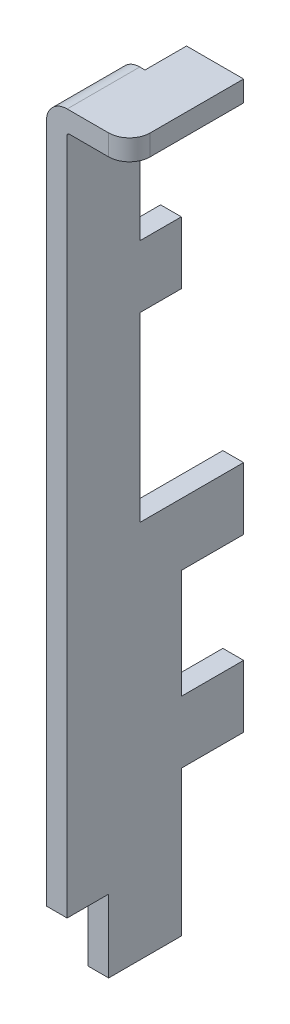
ISO-10303-21;
HEADER;
FILE_DESCRIPTION(('STEP AP214'),'2;1');
FILE_NAME('part.step','',(''),(''),'','','');
FILE_SCHEMA(('AUTOMOTIVE_DESIGN { 1 0 10303 214 1 1 1 1 }'));
ENDSEC;
DATA;
#1=APPLICATION_CONTEXT('core data for automotive mechanical design processes');
#2=APPLICATION_PROTOCOL_DEFINITION('international standard','automotive_design',2000,#1);
#3=PRODUCT_CONTEXT('',#1,'mechanical');
#4=PRODUCT('Part','Part','',(#3));
#5=PRODUCT_RELATED_PRODUCT_CATEGORY('part','',(#4));
#6=PRODUCT_DEFINITION_FORMATION('','',#4);
#7=PRODUCT_DEFINITION_CONTEXT('part definition',#1,'design');
#8=PRODUCT_DEFINITION('design','',#6,#7);
#9=PRODUCT_DEFINITION_SHAPE('','',#8);
#10=(LENGTH_UNIT() NAMED_UNIT(*) SI_UNIT(.MILLI.,.METRE.));
#11=(NAMED_UNIT(*) PLANE_ANGLE_UNIT() SI_UNIT($,.RADIAN.));
#12=(NAMED_UNIT(*) SI_UNIT($,.STERADIAN.) SOLID_ANGLE_UNIT());
#13=UNCERTAINTY_MEASURE_WITH_UNIT(LENGTH_MEASURE(1.E-05),#10,'distance_accuracy_value','');
#14=(GEOMETRIC_REPRESENTATION_CONTEXT(3) GLOBAL_UNCERTAINTY_ASSIGNED_CONTEXT((#13)) GLOBAL_UNIT_ASSIGNED_CONTEXT((#10,
#11,#12)) REPRESENTATION_CONTEXT('',''));
#15=CARTESIAN_POINT('',(0.,0.,0.));
#16=DIRECTION('',(0.,0.,1.));
#17=DIRECTION('',(1.,0.,0.));
#18=AXIS2_PLACEMENT_3D('',#15,#16,#17);
#19=CARTESIAN_POINT('',(5.31,-3.,0.));
#20=DIRECTION('',(0.,1.,0.));
#21=DIRECTION('',(1.,0.,0.));
#22=AXIS2_PLACEMENT_3D('',#19,#20,#21);
#23=PLANE('',#22);
#24=DIRECTION('',(1.,0.,0.));
#25=VECTOR('',#24,1.);
#26=CARTESIAN_POINT('',(0.,-3.,0.));
#27=LINE('',#26,#25);
#28=CARTESIAN_POINT('',(0.,-3.,0.));
#29=VERTEX_POINT('',#28);
#30=CARTESIAN_POINT('',(1.,-3.,0.));
#31=VERTEX_POINT('',#30);
#32=EDGE_CURVE('E278',#29,#31,#27,.T.);
#33=ORIENTED_EDGE('',*,*,#32,.T.);
#34=DIRECTION('',(0.,0.,-1.));
#35=VECTOR('',#34,1.);
#36=CARTESIAN_POINT('',(1.,-3.,2.));
#37=LINE('',#36,#35);
#38=CARTESIAN_POINT('',(1.,-3.,2.));
#39=VERTEX_POINT('',#38);
#40=EDGE_CURVE('E296',#39,#31,#37,.T.);
#41=ORIENTED_EDGE('',*,*,#40,.F.);
#42=DIRECTION('',(1.,0.,0.));
#43=VECTOR('',#42,1.);
#44=CARTESIAN_POINT('',(0.,-3.,2.));
#45=LINE('',#44,#43);
#46=CARTESIAN_POINT('',(0.,-3.,2.));
#47=VERTEX_POINT('',#46);
#48=EDGE_CURVE('E11',#47,#39,#45,.T.);
#49=ORIENTED_EDGE('',*,*,#48,.F.);
#50=DIRECTION('',(0.,0.,-1.));
#51=VECTOR('',#50,1.);
#52=CARTESIAN_POINT('',(0.,-3.,2.));
#53=LINE('',#52,#51);
#54=EDGE_CURVE('E326',#47,#29,#53,.T.);
#55=ORIENTED_EDGE('',*,*,#54,.T.);
#56=EDGE_LOOP('',(#33,#41,#49,#55));
#57=FACE_BOUND('',#56,.T.);
#58=ADVANCED_FACE('F17',(#57),#23,.F.);
#59=CARTESIAN_POINT('',(0.,0.,2.));
#60=DIRECTION('',(0.,0.,1.));
#61=DIRECTION('',(1.,0.,0.));
#62=AXIS2_PLACEMENT_3D('',#59,#60,#61);
#63=PLANE('',#62);
#64=DIRECTION('',(0.,1.,0.));
#65=VECTOR('',#64,1.);
#66=CARTESIAN_POINT('',(0.,-11.7500003906249,2.));
#67=LINE('',#66,#65);
#68=CARTESIAN_POINT('',(0.,-11.7500001953124,2.));
#69=VERTEX_POINT('',#68);
#70=EDGE_CURVE('E395',#69,#47,#67,.T.);
#71=ORIENTED_EDGE('',*,*,#70,.T.);
#72=ORIENTED_EDGE('',*,*,#48,.T.);
#73=DIRECTION('',(0.,1.,0.));
#74=VECTOR('',#73,1.);
#75=CARTESIAN_POINT('',(1.,-11.75,2.));
#76=LINE('',#75,#74);
#77=CARTESIAN_POINT('',(1.,-11.75,2.));
#78=VERTEX_POINT('',#77);
#79=EDGE_CURVE('E287',#78,#39,#76,.T.);
#80=ORIENTED_EDGE('',*,*,#79,.F.);
#81=DIRECTION('',(-1.,0.,0.));
#82=VECTOR('',#81,1.);
#83=CARTESIAN_POINT('',(1.,-11.75,2.));
#84=LINE('',#83,#82);
#85=EDGE_CURVE('E25',#78,#69,#84,.T.);
#86=ORIENTED_EDGE('',*,*,#85,.T.);
#87=EDGE_LOOP('',(#71,#72,#80,#86));
#88=FACE_BOUND('',#87,.T.);
#89=ADVANCED_FACE('F486',(#88),#63,.F.);
#90=CARTESIAN_POINT('',(-2.88,-11.75,0.));
#91=DIRECTION('',(0.,-1.,0.));
#92=DIRECTION('',(0.,0.,-1.));
#93=AXIS2_PLACEMENT_3D('',#90,#91,#92);
#94=PLANE('',#93);
#95=DIRECTION('',(0.,0.,-1.));
#96=VECTOR('',#95,1.);
#97=CARTESIAN_POINT('',(0.,-11.75,2.));
#98=LINE('',#97,#96);
#99=CARTESIAN_POINT('',(0.,-11.75,-3.));
#100=VERTEX_POINT('',#99);
#101=EDGE_CURVE('E399',#69,#100,#98,.T.);
#102=ORIENTED_EDGE('',*,*,#101,.F.);
#103=ORIENTED_EDGE('',*,*,#85,.F.);
#104=DIRECTION('',(0.,0.,-1.));
#105=VECTOR('',#104,1.);
#106=CARTESIAN_POINT('',(1.,-11.7500003906249,2.));
#107=LINE('',#106,#105);
#108=CARTESIAN_POINT('',(1.,-11.7500005859374,-3.));
#109=VERTEX_POINT('',#108);
#110=EDGE_CURVE('E284',#78,#109,#107,.T.);
#111=ORIENTED_EDGE('',*,*,#110,.T.);
#112=DIRECTION('',(1.,0.,0.));
#113=VECTOR('',#112,1.);
#114=CARTESIAN_POINT('',(0.,-11.75,-3.));
#115=LINE('',#114,#113);
#116=EDGE_CURVE('E478',#100,#109,#115,.T.);
#117=ORIENTED_EDGE('',*,*,#116,.F.);
#118=EDGE_LOOP('',(#102,#103,#111,#117));
#119=FACE_BOUND('',#118,.T.);
#120=ADVANCED_FACE('F491',(#119),#94,.F.);
#121=CARTESIAN_POINT('',(0.,0.,-3.));
#122=DIRECTION('',(0.,0.,1.));
#123=DIRECTION('',(1.,0.,0.));
#124=AXIS2_PLACEMENT_3D('',#121,#122,#123);
#125=PLANE('',#124);
#126=DIRECTION('',(-1.,0.,0.));
#127=VECTOR('',#126,1.);
#128=CARTESIAN_POINT('',(1.,-14.75,-3.));
#129=LINE('',#128,#127);
#130=CARTESIAN_POINT('',(1.,-14.75,-3.));
#131=VERTEX_POINT('',#130);
#132=CARTESIAN_POINT('',(0.,-14.75,-3.));
#133=VERTEX_POINT('',#132);
#134=EDGE_CURVE('E475',#131,#133,#129,.T.);
#135=ORIENTED_EDGE('',*,*,#134,.T.);
#136=DIRECTION('',(0.,1.,0.));
#137=VECTOR('',#136,1.);
#138=CARTESIAN_POINT('',(0.,-14.75,-3.));
#139=LINE('',#138,#137);
#140=EDGE_CURVE('E449',#133,#100,#139,.T.);
#141=ORIENTED_EDGE('',*,*,#140,.T.);
#142=ORIENTED_EDGE('',*,*,#116,.T.);
#143=DIRECTION('',(0.,-1.,0.));
#144=VECTOR('',#143,1.);
#145=CARTESIAN_POINT('',(1.,-11.7500003906249,-3.));
#146=LINE('',#145,#144);
#147=EDGE_CURVE('E288',#109,#131,#146,.T.);
#148=ORIENTED_EDGE('',*,*,#147,.T.);
#149=EDGE_LOOP('',(#135,#141,#142,#148));
#150=FACE_BOUND('',#149,.T.);
#151=ADVANCED_FACE('F506',(#150),#125,.F.);
#152=CARTESIAN_POINT('',(0.,-14.75,0.));
#153=DIRECTION('',(0.,-1.,0.));
#154=DIRECTION('',(0.,0.,-1.));
#155=AXIS2_PLACEMENT_3D('',#152,#153,#154);
#156=PLANE('',#155);
#157=DIRECTION('',(-1.,0.,0.));
#158=VECTOR('',#157,1.);
#159=CARTESIAN_POINT('',(1.,-14.75,0.));
#160=LINE('',#159,#158);
#161=CARTESIAN_POINT('',(1.,-14.75,0.));
#162=VERTEX_POINT('',#161);
#163=CARTESIAN_POINT('',(0.,-14.75,0.));
#164=VERTEX_POINT('',#163);
#165=EDGE_CURVE('E439',#162,#164,#160,.T.);
#166=ORIENTED_EDGE('',*,*,#165,.T.);
#167=DIRECTION('',(0.,0.,1.));
#168=VECTOR('',#167,1.);
#169=CARTESIAN_POINT('',(0.,-14.75,-3.));
#170=LINE('',#169,#168);
#171=EDGE_CURVE('E456',#133,#164,#170,.T.);
#172=ORIENTED_EDGE('',*,*,#171,.F.);
#173=ORIENTED_EDGE('',*,*,#134,.F.);
#174=DIRECTION('',(0.,0.,1.));
#175=VECTOR('',#174,1.);
#176=CARTESIAN_POINT('',(1.,-14.75,-3.));
#177=LINE('',#176,#175);
#178=EDGE_CURVE('E421',#131,#162,#177,.T.);
#179=ORIENTED_EDGE('',*,*,#178,.T.);
#180=EDGE_LOOP('',(#166,#172,#173,#179));
#181=FACE_BOUND('',#180,.T.);
#182=ADVANCED_FACE('F786',(#181),#156,.T.);
#183=CARTESIAN_POINT('',(0.,0.,0.));
#184=DIRECTION('',(0.,0.,1.));
#185=DIRECTION('',(1.,0.,0.));
#186=AXIS2_PLACEMENT_3D('',#183,#184,#185);
#187=PLANE('',#186);
#188=ORIENTED_EDGE('',*,*,#165,.F.);
#189=DIRECTION('',(0.,-1.,0.));
#190=VECTOR('',#189,1.);
#191=CARTESIAN_POINT('',(1.,-14.75,0.));
#192=LINE('',#191,#190);
#193=CARTESIAN_POINT('',(1.,-20.00000092,0.));
#194=VERTEX_POINT('',#193);
#195=EDGE_CURVE('E417',#162,#194,#192,.T.);
#196=ORIENTED_EDGE('',*,*,#195,.T.);
#197=DIRECTION('',(-1.,0.,0.));
#198=VECTOR('',#197,1.);
#199=CARTESIAN_POINT('',(1.,-20.00000092,0.));
#200=LINE('',#199,#198);
#201=CARTESIAN_POINT('',(0.,-20.00000092,0.));
#202=VERTEX_POINT('',#201);
#203=EDGE_CURVE('E436',#194,#202,#200,.T.);
#204=ORIENTED_EDGE('',*,*,#203,.T.);
#205=DIRECTION('',(0.,1.,0.));
#206=VECTOR('',#205,1.);
#207=CARTESIAN_POINT('',(0.,-20.00000092,0.));
#208=LINE('',#207,#206);
#209=EDGE_CURVE('E512',#202,#164,#208,.T.);
#210=ORIENTED_EDGE('',*,*,#209,.T.);
#211=EDGE_LOOP('',(#188,#196,#204,#210));
#212=FACE_BOUND('',#211,.T.);
#213=ADVANCED_FACE('F785',(#212),#187,.F.);
#214=CARTESIAN_POINT('',(1.,-20.00000092,0.));
#215=DIRECTION('',(0.,1.,0.));
#216=DIRECTION('',(1.,0.,0.));
#217=AXIS2_PLACEMENT_3D('',#214,#215,#216);
#218=PLANE('',#217);
#219=ORIENTED_EDGE('',*,*,#203,.F.);
#220=DIRECTION('',(0.,0.,1.));
#221=VECTOR('',#220,1.);
#222=CARTESIAN_POINT('',(1.,-20.00000092,-3.));
#223=LINE('',#222,#221);
#224=CARTESIAN_POINT('',(1.,-20.00000092,-3.));
#225=VERTEX_POINT('',#224);
#226=EDGE_CURVE('E413',#225,#194,#223,.T.);
#227=ORIENTED_EDGE('',*,*,#226,.F.);
#228=DIRECTION('',(1.,0.,0.));
#229=VECTOR('',#228,1.);
#230=CARTESIAN_POINT('',(0.,-20.00000092,-3.));
#231=LINE('',#230,#229);
#232=CARTESIAN_POINT('',(0.,-20.00000092,-3.));
#233=VERTEX_POINT('',#232);
#234=EDGE_CURVE('E440',#233,#225,#231,.T.);
#235=ORIENTED_EDGE('',*,*,#234,.F.);
#236=DIRECTION('',(0.,0.,1.));
#237=VECTOR('',#236,1.);
#238=CARTESIAN_POINT('',(0.,-20.00000092,-3.));
#239=LINE('',#238,#237);
#240=EDGE_CURVE('E462',#233,#202,#239,.T.);
#241=ORIENTED_EDGE('',*,*,#240,.T.);
#242=EDGE_LOOP('',(#219,#227,#235,#241));
#243=FACE_BOUND('',#242,.T.);
#244=ADVANCED_FACE('F783',(#243),#218,.T.);
#245=CARTESIAN_POINT('',(0.,0.,-3.));
#246=DIRECTION('',(0.,0.,1.));
#247=DIRECTION('',(1.,0.,0.));
#248=AXIS2_PLACEMENT_3D('',#245,#246,#247);
#249=PLANE('',#248);
#250=ORIENTED_EDGE('',*,*,#234,.T.);
#251=DIRECTION('',(0.,-1.,0.));
#252=VECTOR('',#251,1.);
#253=CARTESIAN_POINT('',(1.,-20.00000092,-3.));
#254=LINE('',#253,#252);
#255=CARTESIAN_POINT('',(1.,-23.,-3.));
#256=VERTEX_POINT('',#255);
#257=EDGE_CURVE('E405',#225,#256,#254,.T.);
#258=ORIENTED_EDGE('',*,*,#257,.T.);
#259=DIRECTION('',(-1.,0.,0.));
#260=VECTOR('',#259,1.);
#261=CARTESIAN_POINT('',(1.,-23.,-3.));
#262=LINE('',#261,#260);
#263=CARTESIAN_POINT('',(0.,-23.,-3.));
#264=VERTEX_POINT('',#263);
#265=EDGE_CURVE('E359',#256,#264,#262,.T.);
#266=ORIENTED_EDGE('',*,*,#265,.T.);
#267=DIRECTION('',(0.,1.,0.));
#268=VECTOR('',#267,1.);
#269=CARTESIAN_POINT('',(0.,-23.,-3.));
#270=LINE('',#269,#268);
#271=EDGE_CURVE('E457',#264,#233,#270,.T.);
#272=ORIENTED_EDGE('',*,*,#271,.T.);
#273=EDGE_LOOP('',(#250,#258,#266,#272));
#274=FACE_BOUND('',#273,.T.);
#275=ADVANCED_FACE('F780',(#274),#249,.F.);
#276=CARTESIAN_POINT('',(0.,-23.,0.));
#277=DIRECTION('',(0.,-1.,0.));
#278=DIRECTION('',(0.,0.,-1.));
#279=AXIS2_PLACEMENT_3D('',#276,#277,#278);
#280=PLANE('',#279);
#281=DIRECTION('',(-1.,0.,0.));
#282=VECTOR('',#281,1.);
#283=CARTESIAN_POINT('',(1.,-23.,0.));
#284=LINE('',#283,#282);
#285=CARTESIAN_POINT('',(1.,-23.,0.));
#286=VERTEX_POINT('',#285);
#287=CARTESIAN_POINT('',(0.,-23.,0.));
#288=VERTEX_POINT('',#287);
#289=EDGE_CURVE('E47',#286,#288,#284,.T.);
#290=ORIENTED_EDGE('',*,*,#289,.T.);
#291=DIRECTION('',(0.,0.,1.));
#292=VECTOR('',#291,1.);
#293=CARTESIAN_POINT('',(0.,-23.,-3.));
#294=LINE('',#293,#292);
#295=EDGE_CURVE('E461',#264,#288,#294,.T.);
#296=ORIENTED_EDGE('',*,*,#295,.F.);
#297=ORIENTED_EDGE('',*,*,#265,.F.);
#298=DIRECTION('',(0.,0.,1.));
#299=VECTOR('',#298,1.);
#300=CARTESIAN_POINT('',(1.,-23.,-3.));
#301=LINE('',#300,#299);
#302=EDGE_CURVE('E402',#256,#286,#301,.T.);
#303=ORIENTED_EDGE('',*,*,#302,.T.);
#304=EDGE_LOOP('',(#290,#296,#297,#303));
#305=FACE_BOUND('',#304,.T.);
#306=ADVANCED_FACE('F777',(#305),#280,.T.);
#307=CARTESIAN_POINT('',(0.,0.,0.));
#308=DIRECTION('',(0.,0.,1.));
#309=DIRECTION('',(1.,0.,0.));
#310=AXIS2_PLACEMENT_3D('',#307,#308,#309);
#311=PLANE('',#310);
#312=ORIENTED_EDGE('',*,*,#289,.F.);
#313=DIRECTION('',(0.,-1.,0.));
#314=VECTOR('',#313,1.);
#315=CARTESIAN_POINT('',(1.,-23.,0.));
#316=LINE('',#315,#314);
#317=CARTESIAN_POINT('',(1.,-30.,0.));
#318=VERTEX_POINT('',#317);
#319=EDGE_CURVE('E382',#286,#318,#316,.T.);
#320=ORIENTED_EDGE('',*,*,#319,.T.);
#321=DIRECTION('',(-1.,0.,0.));
#322=VECTOR('',#321,1.);
#323=CARTESIAN_POINT('',(1.,-30.,0.));
#324=LINE('',#323,#322);
#325=CARTESIAN_POINT('',(0.,-30.,0.));
#326=VERTEX_POINT('',#325);
#327=EDGE_CURVE('E37',#318,#326,#324,.T.);
#328=ORIENTED_EDGE('',*,*,#327,.T.);
#329=DIRECTION('',(0.,1.,0.));
#330=VECTOR('',#329,1.);
#331=CARTESIAN_POINT('',(0.,-30.,0.));
#332=LINE('',#331,#330);
#333=EDGE_CURVE('E466',#326,#288,#332,.T.);
#334=ORIENTED_EDGE('',*,*,#333,.T.);
#335=EDGE_LOOP('',(#312,#320,#328,#334));
#336=FACE_BOUND('',#335,.T.);
#337=ADVANCED_FACE('F775',(#336),#311,.F.);
#338=CARTESIAN_POINT('',(0.,-30.,0.));
#339=DIRECTION('',(0.,-1.,0.));
#340=DIRECTION('',(0.,0.,-1.));
#341=AXIS2_PLACEMENT_3D('',#338,#339,#340);
#342=PLANE('',#341);
#343=DIRECTION('',(-1.,0.,0.));
#344=VECTOR('',#343,1.);
#345=CARTESIAN_POINT('',(1.,-30.,3.5));
#346=LINE('',#345,#344);
#347=CARTESIAN_POINT('',(1.,-30.,3.5));
#348=VERTEX_POINT('',#347);
#349=CARTESIAN_POINT('',(0.,-30.,3.5));
#350=VERTEX_POINT('',#349);
#351=EDGE_CURVE('E322',#348,#350,#346,.T.);
#352=ORIENTED_EDGE('',*,*,#351,.T.);
#353=DIRECTION('',(0.,0.,-1.));
#354=VECTOR('',#353,1.);
#355=CARTESIAN_POINT('',(0.,-30.,3.5));
#356=LINE('',#355,#354);
#357=EDGE_CURVE('E452',#350,#326,#356,.T.);
#358=ORIENTED_EDGE('',*,*,#357,.T.);
#359=ORIENTED_EDGE('',*,*,#327,.F.);
#360=DIRECTION('',(0.,0.,-1.));
#361=VECTOR('',#360,1.);
#362=CARTESIAN_POINT('',(1.,-30.,3.5));
#363=LINE('',#362,#361);
#364=EDGE_CURVE('E378',#348,#318,#363,.T.);
#365=ORIENTED_EDGE('',*,*,#364,.F.);
#366=EDGE_LOOP('',(#352,#358,#359,#365));
#367=FACE_BOUND('',#366,.T.);
#368=ADVANCED_FACE('F771',(#367),#342,.T.);
#369=CARTESIAN_POINT('',(0.,7.25,0.));
#370=DIRECTION('',(-1.,0.,0.));
#371=DIRECTION('',(0.,0.,1.));
#372=AXIS2_PLACEMENT_3D('',#369,#370,#371);
#373=PLANE('',#372);
#374=DIRECTION('',(0.,1.,0.));
#375=VECTOR('',#374,1.);
#376=CARTESIAN_POINT('',(0.,-26.5,5.5));
#377=LINE('',#376,#375);
#378=CARTESIAN_POINT('',(0.,-26.5,5.5));
#379=VERTEX_POINT('',#378);
#380=CARTESIAN_POINT('',(0.,6.25,5.5));
#381=VERTEX_POINT('',#380);
#382=EDGE_CURVE('E406',#379,#381,#377,.T.);
#383=ORIENTED_EDGE('',*,*,#382,.T.);
#384=DIRECTION('',(0.,0.,-1.));
#385=VECTOR('',#384,1.);
#386=CARTESIAN_POINT('',(0.,6.25,5.5));
#387=LINE('',#386,#385);
#388=CARTESIAN_POINT('',(0.,6.25,2.));
#389=VERTEX_POINT('',#388);
#390=EDGE_CURVE('E246',#381,#389,#387,.T.);
#391=ORIENTED_EDGE('',*,*,#390,.T.);
#392=DIRECTION('',(0.,1.,0.));
#393=VECTOR('',#392,1.);
#394=CARTESIAN_POINT('',(0.,0.,2.));
#395=LINE('',#394,#393);
#396=CARTESIAN_POINT('',(0.,0.,2.));
#397=VERTEX_POINT('',#396);
#398=EDGE_CURVE('E239',#397,#389,#395,.T.);
#399=ORIENTED_EDGE('',*,*,#398,.F.);
#400=DIRECTION('',(0.,0.,-1.));
#401=VECTOR('',#400,1.);
#402=CARTESIAN_POINT('',(0.,0.,2.));
#403=LINE('',#402,#401);
#404=CARTESIAN_POINT('',(0.,0.,0.));
#405=VERTEX_POINT('',#404);
#406=EDGE_CURVE('E243',#397,#405,#403,.T.);
#407=ORIENTED_EDGE('',*,*,#406,.T.);
#408=DIRECTION('',(0.,1.,0.));
#409=VECTOR('',#408,1.);
#410=CARTESIAN_POINT('',(0.,-3.,0.));
#411=LINE('',#410,#409);
#412=EDGE_CURVE('E270',#29,#405,#411,.T.);
#413=ORIENTED_EDGE('',*,*,#412,.F.);
#414=ORIENTED_EDGE('',*,*,#54,.F.);
#415=ORIENTED_EDGE('',*,*,#70,.F.);
#416=ORIENTED_EDGE('',*,*,#101,.T.);
#417=ORIENTED_EDGE('',*,*,#140,.F.);
#418=ORIENTED_EDGE('',*,*,#171,.T.);
#419=ORIENTED_EDGE('',*,*,#209,.F.);
#420=ORIENTED_EDGE('',*,*,#240,.F.);
#421=ORIENTED_EDGE('',*,*,#271,.F.);
#422=ORIENTED_EDGE('',*,*,#295,.T.);
#423=ORIENTED_EDGE('',*,*,#333,.F.);
#424=ORIENTED_EDGE('',*,*,#357,.F.);
#425=DIRECTION('',(0.,-1.,0.));
#426=VECTOR('',#425,1.);
#427=CARTESIAN_POINT('',(0.,-26.5,3.5));
#428=LINE('',#427,#426);
#429=CARTESIAN_POINT('',(0.,-26.5,3.5));
#430=VERTEX_POINT('',#429);
#431=EDGE_CURVE('E327',#430,#350,#428,.T.);
#432=ORIENTED_EDGE('',*,*,#431,.F.);
#433=DIRECTION('',(0.,0.,1.));
#434=VECTOR('',#433,1.);
#435=CARTESIAN_POINT('',(0.,-26.5,3.5));
#436=LINE('',#435,#434);
#437=EDGE_CURVE('E432',#430,#379,#436,.T.);
#438=ORIENTED_EDGE('',*,*,#437,.T.);
#439=EDGE_LOOP('',(#383,#391,#399,#407,#413,#414,#415,#416,#417,#418,#419,#420,#421,#422,#423,
#424,#432,#438));
#440=FACE_BOUND('',#439,.T.);
#441=ADVANCED_FACE('F241',(#440),#373,.T.);
#442=CARTESIAN_POINT('',(0.,-30.,3.5));
#443=DIRECTION('',(0.,0.,-1.));
#444=DIRECTION('',(0.,-1.,0.));
#445=AXIS2_PLACEMENT_3D('',#442,#443,#444);
#446=PLANE('',#445);
#447=ORIENTED_EDGE('',*,*,#431,.T.);
#448=ORIENTED_EDGE('',*,*,#351,.F.);
#449=DIRECTION('',(0.,-1.,0.));
#450=VECTOR('',#449,1.);
#451=CARTESIAN_POINT('',(1.,-26.5,3.5));
#452=LINE('',#451,#450);
#453=CARTESIAN_POINT('',(1.,-26.5,3.5));
#454=VERTEX_POINT('',#453);
#455=EDGE_CURVE('E383',#454,#348,#452,.T.);
#456=ORIENTED_EDGE('',*,*,#455,.F.);
#457=DIRECTION('',(-1.,0.,0.));
#458=VECTOR('',#457,1.);
#459=CARTESIAN_POINT('',(1.,-26.5,3.5));
#460=LINE('',#459,#458);
#461=EDGE_CURVE('E435',#454,#430,#460,.T.);
#462=ORIENTED_EDGE('',*,*,#461,.T.);
#463=EDGE_LOOP('',(#447,#448,#456,#462));
#464=FACE_BOUND('',#463,.T.);
#465=ADVANCED_FACE('F768',(#464),#446,.F.);
#466=CARTESIAN_POINT('',(0.,-26.5,3.5));
#467=DIRECTION('',(0.,1.,0.));
#468=DIRECTION('',(1.,0.,0.));
#469=AXIS2_PLACEMENT_3D('',#466,#467,#468);
#470=PLANE('',#469);
#471=DIRECTION('',(1.,0.,0.));
#472=VECTOR('',#471,1.);
#473=CARTESIAN_POINT('',(0.,-26.5,5.5));
#474=LINE('',#473,#472);
#475=CARTESIAN_POINT('',(1.,-26.5,5.5));
#476=VERTEX_POINT('',#475);
#477=EDGE_CURVE('E409',#379,#476,#474,.T.);
#478=ORIENTED_EDGE('',*,*,#477,.F.);
#479=ORIENTED_EDGE('',*,*,#437,.F.);
#480=ORIENTED_EDGE('',*,*,#461,.F.);
#481=DIRECTION('',(0.,0.,1.));
#482=VECTOR('',#481,1.);
#483=CARTESIAN_POINT('',(1.,-26.5,3.5));
#484=LINE('',#483,#482);
#485=EDGE_CURVE('E394',#454,#476,#484,.T.);
#486=ORIENTED_EDGE('',*,*,#485,.T.);
#487=EDGE_LOOP('',(#478,#479,#480,#486));
#488=FACE_BOUND('',#487,.T.);
#489=ADVANCED_FACE('F765',(#488),#470,.F.);
#490=CARTESIAN_POINT('',(0.,0.,5.5));
#491=DIRECTION('',(0.,0.,1.));
#492=DIRECTION('',(1.,0.,0.));
#493=AXIS2_PLACEMENT_3D('',#490,#491,#492);
#494=PLANE('',#493);
#495=DIRECTION('',(0.,1.,0.));
#496=VECTOR('',#495,1.);
#497=CARTESIAN_POINT('',(3.,6.25,5.5));
#498=LINE('',#497,#496);
#499=CARTESIAN_POINT('',(3.,6.25,5.5));
#500=VERTEX_POINT('',#499);
#501=CARTESIAN_POINT('',(3.,7.25,5.5));
#502=VERTEX_POINT('',#501);
#503=EDGE_CURVE('E349',#500,#502,#498,.T.);
#504=ORIENTED_EDGE('',*,*,#503,.T.);
#505=DIRECTION('',(1.,0.,0.));
#506=VECTOR('',#505,1.);
#507=CARTESIAN_POINT('',(1.,7.25,5.5));
#508=LINE('',#507,#506);
#509=CARTESIAN_POINT('',(1.,7.25,5.5));
#510=VERTEX_POINT('',#509);
#511=EDGE_CURVE('E345',#510,#502,#508,.T.);
#512=ORIENTED_EDGE('',*,*,#511,.F.);
#513=CARTESIAN_POINT('',(1.,6.25,5.5));
#514=DIRECTION('',(0.,0.,-1.));
#515=DIRECTION('',(-1.,0.,0.));
#516=AXIS2_PLACEMENT_3D('',#513,#514,#515);
#517=CIRCLE('',#516,1.);
#518=EDGE_CURVE('E313',#381,#510,#517,.T.);
#519=ORIENTED_EDGE('',*,*,#518,.F.);
#520=ORIENTED_EDGE('',*,*,#382,.F.);
#521=ORIENTED_EDGE('',*,*,#477,.T.);
#522=DIRECTION('',(0.,-1.,0.));
#523=VECTOR('',#522,1.);
#524=CARTESIAN_POINT('',(1.,6.15,5.5));
#525=LINE('',#524,#523);
#526=CARTESIAN_POINT('',(1.,6.15,5.5));
#527=VERTEX_POINT('',#526);
#528=EDGE_CURVE('E281',#527,#476,#525,.T.);
#529=ORIENTED_EDGE('',*,*,#528,.F.);
#530=CARTESIAN_POINT('',(1.1,6.15,5.5));
#531=DIRECTION('',(0.,0.,1.));
#532=DIRECTION('',(0.,1.,0.));
#533=AXIS2_PLACEMENT_3D('',#530,#531,#532);
#534=CIRCLE('',#533,0.1);
#535=CARTESIAN_POINT('',(1.1,6.25,5.5));
#536=VERTEX_POINT('',#535);
#537=EDGE_CURVE('E311',#536,#527,#534,.T.);
#538=ORIENTED_EDGE('',*,*,#537,.F.);
#539=DIRECTION('',(-1.,0.,0.));
#540=VECTOR('',#539,1.);
#541=CARTESIAN_POINT('',(3.,6.25,5.5));
#542=LINE('',#541,#540);
#543=EDGE_CURVE('E364',#500,#536,#542,.T.);
#544=ORIENTED_EDGE('',*,*,#543,.F.);
#545=EDGE_LOOP('',(#504,#512,#519,#520,#521,#529,#538,#544));
#546=FACE_BOUND('',#545,.T.);
#547=ADVANCED_FACE('F758',(#546),#494,.T.);
#548=CARTESIAN_POINT('',(1.,-30.,0.));
#549=DIRECTION('',(1.,0.,0.));
#550=DIRECTION('',(0.,1.,0.));
#551=AXIS2_PLACEMENT_3D('',#548,#549,#550);
#552=PLANE('',#551);
#553=ORIENTED_EDGE('',*,*,#528,.T.);
#554=ORIENTED_EDGE('',*,*,#485,.F.);
#555=ORIENTED_EDGE('',*,*,#455,.T.);
#556=ORIENTED_EDGE('',*,*,#364,.T.);
#557=ORIENTED_EDGE('',*,*,#319,.F.);
#558=ORIENTED_EDGE('',*,*,#302,.F.);
#559=ORIENTED_EDGE('',*,*,#257,.F.);
#560=ORIENTED_EDGE('',*,*,#226,.T.);
#561=ORIENTED_EDGE('',*,*,#195,.F.);
#562=ORIENTED_EDGE('',*,*,#178,.F.);
#563=ORIENTED_EDGE('',*,*,#147,.F.);
#564=ORIENTED_EDGE('',*,*,#110,.F.);
#565=ORIENTED_EDGE('',*,*,#79,.T.);
#566=ORIENTED_EDGE('',*,*,#40,.T.);
#567=DIRECTION('',(0.,-1.,0.));
#568=VECTOR('',#567,1.);
#569=CARTESIAN_POINT('',(1.,0.,0.));
#570=LINE('',#569,#568);
#571=CARTESIAN_POINT('',(1.,0.,0.));
#572=VERTEX_POINT('',#571);
#573=EDGE_CURVE('E521',#572,#31,#570,.T.);
#574=ORIENTED_EDGE('',*,*,#573,.F.);
#575=DIRECTION('',(0.,0.,-1.));
#576=VECTOR('',#575,1.);
#577=CARTESIAN_POINT('',(1.,0.,2.));
#578=LINE('',#577,#576);
#579=CARTESIAN_POINT('',(1.,0.,2.));
#580=VERTEX_POINT('',#579);
#581=EDGE_CURVE('E263',#580,#572,#578,.T.);
#582=ORIENTED_EDGE('',*,*,#581,.F.);
#583=DIRECTION('',(0.,1.,0.));
#584=VECTOR('',#583,1.);
#585=CARTESIAN_POINT('',(1.,0.,2.));
#586=LINE('',#585,#584);
#587=CARTESIAN_POINT('',(1.,6.15,2.));
#588=VERTEX_POINT('',#587);
#589=EDGE_CURVE('E252',#580,#588,#586,.T.);
#590=ORIENTED_EDGE('',*,*,#589,.T.);
#591=DIRECTION('',(0.,0.,1.));
#592=VECTOR('',#591,1.);
#593=CARTESIAN_POINT('',(1.,6.15,2.));
#594=LINE('',#593,#592);
#595=EDGE_CURVE('E387',#588,#527,#594,.T.);
#596=ORIENTED_EDGE('',*,*,#595,.T.);
#597=EDGE_LOOP('',(#553,#554,#555,#556,#557,#558,#559,#560,#561,#562,#563,#564,#565,#566,#574,
#582,#590,#596));
#598=FACE_BOUND('',#597,.T.);
#599=ADVANCED_FACE('F501',(#598),#552,.T.);
#600=CARTESIAN_POINT('',(1.1,6.15,-16.57189395129));
#601=DIRECTION('',(0.,0.,1.));
#602=DIRECTION('',(0.,1.,0.));
#603=AXIS2_PLACEMENT_3D('',#600,#601,#602);
#604=CYLINDRICAL_SURFACE('',#603,0.1);
#605=DIRECTION('',(0.,0.,-1.));
#606=VECTOR('',#605,1.);
#607=CARTESIAN_POINT('',(1.1,6.25,5.5));
#608=LINE('',#607,#606);
#609=CARTESIAN_POINT('',(1.1,6.25,2.));
#610=VERTEX_POINT('',#609);
#611=EDGE_CURVE('E312',#536,#610,#608,.T.);
#612=ORIENTED_EDGE('',*,*,#611,.F.);
#613=ORIENTED_EDGE('',*,*,#537,.T.);
#614=ORIENTED_EDGE('',*,*,#595,.F.);
#615=CARTESIAN_POINT('',(1.1,6.15,2.));
#616=DIRECTION('',(0.,0.,-1.));
#617=DIRECTION('',(-1.,0.,0.));
#618=AXIS2_PLACEMENT_3D('',#615,#616,#617);
#619=CIRCLE('',#618,0.1);
#620=EDGE_CURVE('E307',#588,#610,#619,.T.);
#621=ORIENTED_EDGE('',*,*,#620,.T.);
#622=EDGE_LOOP('',(#612,#613,#614,#621));
#623=FACE_BOUND('',#622,.T.);
#624=ADVANCED_FACE('F756',(#623),#604,.F.);
#625=CARTESIAN_POINT('',(1.25,6.25,2.));
#626=DIRECTION('',(-1.,0.,0.));
#627=DIRECTION('',(0.,0.,1.));
#628=AXIS2_PLACEMENT_3D('',#625,#626,#627);
#629=PLANE('',#628);
#630=DIRECTION('',(0.,1.,0.));
#631=VECTOR('',#630,1.);
#632=CARTESIAN_POINT('',(1.25,6.25,2.));
#633=LINE('',#632,#631);
#634=CARTESIAN_POINT('',(1.25,6.25,2.));
#635=VERTEX_POINT('',#634);
#636=CARTESIAN_POINT('',(1.25,7.25,2.));
#637=VERTEX_POINT('',#636);
#638=EDGE_CURVE('E300',#635,#637,#633,.T.);
#639=ORIENTED_EDGE('',*,*,#638,.T.);
#640=DIRECTION('',(0.,0.,1.));
#641=VECTOR('',#640,1.);
#642=CARTESIAN_POINT('',(1.25,7.25,0.));
#643=LINE('',#642,#641);
#644=CARTESIAN_POINT('',(1.25,7.25,0.));
#645=VERTEX_POINT('',#644);
#646=EDGE_CURVE('E344',#645,#637,#643,.T.);
#647=ORIENTED_EDGE('',*,*,#646,.F.);
#648=DIRECTION('',(0.,-1.,0.));
#649=VECTOR('',#648,1.);
#650=CARTESIAN_POINT('',(1.25,7.25,0.));
#651=LINE('',#650,#649);
#652=CARTESIAN_POINT('',(1.25,6.25,0.));
#653=VERTEX_POINT('',#652);
#654=EDGE_CURVE('E360',#645,#653,#651,.T.);
#655=ORIENTED_EDGE('',*,*,#654,.T.);
#656=DIRECTION('',(0.,0.,1.));
#657=VECTOR('',#656,1.);
#658=CARTESIAN_POINT('',(1.25,6.25,0.));
#659=LINE('',#658,#657);
#660=EDGE_CURVE('E308',#653,#635,#659,.T.);
#661=ORIENTED_EDGE('',*,*,#660,.T.);
#662=EDGE_LOOP('',(#639,#647,#655,#661));
#663=FACE_BOUND('',#662,.T.);
#664=ADVANCED_FACE('F929',(#663),#629,.T.);
#665=CARTESIAN_POINT('',(1.,6.25,0.));
#666=DIRECTION('',(0.,-1.,0.));
#667=DIRECTION('',(0.,0.,-1.));
#668=AXIS2_PLACEMENT_3D('',#665,#666,#667);
#669=PLANE('',#668);
#670=CARTESIAN_POINT('',(3.,6.25,4.5));
#671=DIRECTION('',(0.,1.,0.));
#672=DIRECTION('',(0.,0.,1.));
#673=AXIS2_PLACEMENT_3D('',#670,#671,#672);
#674=CIRCLE('',#673,1.);
#675=CARTESIAN_POINT('',(4.,6.25,4.5));
#676=VERTEX_POINT('',#675);
#677=EDGE_CURVE('E352',#500,#676,#674,.T.);
#678=ORIENTED_EDGE('',*,*,#677,.F.);
#679=ORIENTED_EDGE('',*,*,#543,.T.);
#680=ORIENTED_EDGE('',*,*,#611,.T.);
#681=DIRECTION('',(-1.,0.,0.));
#682=VECTOR('',#681,1.);
#683=CARTESIAN_POINT('',(1.25,6.25,2.));
#684=LINE('',#683,#682);
#685=EDGE_CURVE('E304',#635,#610,#684,.T.);
#686=ORIENTED_EDGE('',*,*,#685,.F.);
#687=ORIENTED_EDGE('',*,*,#660,.F.);
#688=DIRECTION('',(1.,0.,0.));
#689=VECTOR('',#688,1.);
#690=CARTESIAN_POINT('',(1.25,6.25,0.));
#691=LINE('',#690,#689);
#692=CARTESIAN_POINT('',(4.,6.25,0.));
#693=VERTEX_POINT('',#692);
#694=EDGE_CURVE('E331',#653,#693,#691,.T.);
#695=ORIENTED_EDGE('',*,*,#694,.T.);
#696=DIRECTION('',(0.,0.,-1.));
#697=VECTOR('',#696,1.);
#698=CARTESIAN_POINT('',(4.,6.25,4.5));
#699=LINE('',#698,#697);
#700=EDGE_CURVE('E332',#676,#693,#699,.T.);
#701=ORIENTED_EDGE('',*,*,#700,.F.);
#702=EDGE_LOOP('',(#678,#679,#680,#686,#687,#695,#701));
#703=FACE_BOUND('',#702,.T.);
#704=ADVANCED_FACE('F939',(#703),#669,.T.);
#705=CARTESIAN_POINT('',(0.,0.,0.));
#706=DIRECTION('',(0.,0.,1.));
#707=DIRECTION('',(1.,0.,0.));
#708=AXIS2_PLACEMENT_3D('',#705,#706,#707);
#709=PLANE('',#708);
#710=ORIENTED_EDGE('',*,*,#694,.F.);
#711=ORIENTED_EDGE('',*,*,#654,.F.);
#712=DIRECTION('',(-1.,0.,0.));
#713=VECTOR('',#712,1.);
#714=CARTESIAN_POINT('',(4.,7.25,0.));
#715=LINE('',#714,#713);
#716=CARTESIAN_POINT('',(4.,7.25,0.));
#717=VERTEX_POINT('',#716);
#718=EDGE_CURVE('E340',#717,#645,#715,.T.);
#719=ORIENTED_EDGE('',*,*,#718,.F.);
#720=DIRECTION('',(0.,1.,0.));
#721=VECTOR('',#720,1.);
#722=CARTESIAN_POINT('',(4.,6.25,0.));
#723=LINE('',#722,#721);
#724=EDGE_CURVE('E328',#693,#717,#723,.T.);
#725=ORIENTED_EDGE('',*,*,#724,.F.);
#726=EDGE_LOOP('',(#710,#711,#719,#725));
#727=FACE_BOUND('',#726,.T.);
#728=ADVANCED_FACE('F950',(#727),#709,.F.);
#729=CARTESIAN_POINT('',(4.,6.25,0.));
#730=DIRECTION('',(1.,0.,0.));
#731=DIRECTION('',(0.,1.,0.));
#732=AXIS2_PLACEMENT_3D('',#729,#730,#731);
#733=PLANE('',#732);
#734=DIRECTION('',(0.,-1.,0.));
#735=VECTOR('',#734,1.);
#736=CARTESIAN_POINT('',(4.,7.25,4.5));
#737=LINE('',#736,#735);
#738=CARTESIAN_POINT('',(4.,7.25,4.5));
#739=VERTEX_POINT('',#738);
#740=EDGE_CURVE('E356',#739,#676,#737,.T.);
#741=ORIENTED_EDGE('',*,*,#740,.T.);
#742=ORIENTED_EDGE('',*,*,#700,.T.);
#743=ORIENTED_EDGE('',*,*,#724,.T.);
#744=DIRECTION('',(0.,0.,1.));
#745=VECTOR('',#744,1.);
#746=CARTESIAN_POINT('',(4.,7.25,0.));
#747=LINE('',#746,#745);
#748=EDGE_CURVE('E336',#717,#739,#747,.T.);
#749=ORIENTED_EDGE('',*,*,#748,.T.);
#750=EDGE_LOOP('',(#741,#742,#743,#749));
#751=FACE_BOUND('',#750,.T.);
#752=ADVANCED_FACE('F961',(#751),#733,.T.);
#753=CARTESIAN_POINT('',(3.,-70.78987602547,4.5));
#754=DIRECTION('',(0.,1.,0.));
#755=DIRECTION('',(0.,0.,1.));
#756=AXIS2_PLACEMENT_3D('',#753,#754,#755);
#757=CYLINDRICAL_SURFACE('',#756,1.);
#758=CARTESIAN_POINT('',(3.,7.25,4.5));
#759=DIRECTION('',(0.,-1.,0.));
#760=DIRECTION('',(1.,0.,0.));
#761=AXIS2_PLACEMENT_3D('',#758,#759,#760);
#762=CIRCLE('',#761,1.);
#763=EDGE_CURVE('E321',#739,#502,#762,.T.);
#764=ORIENTED_EDGE('',*,*,#763,.T.);
#765=ORIENTED_EDGE('',*,*,#503,.F.);
#766=ORIENTED_EDGE('',*,*,#677,.T.);
#767=ORIENTED_EDGE('',*,*,#740,.F.);
#768=EDGE_LOOP('',(#764,#765,#766,#767));
#769=FACE_BOUND('',#768,.T.);
#770=ADVANCED_FACE('F972',(#769),#757,.T.);
#771=CARTESIAN_POINT('',(4.,7.25,0.));
#772=DIRECTION('',(0.,1.,0.));
#773=DIRECTION('',(1.,0.,0.));
#774=AXIS2_PLACEMENT_3D('',#771,#772,#773);
#775=PLANE('',#774);
#776=ORIENTED_EDGE('',*,*,#763,.F.);
#777=ORIENTED_EDGE('',*,*,#748,.F.);
#778=ORIENTED_EDGE('',*,*,#718,.T.);
#779=ORIENTED_EDGE('',*,*,#646,.T.);
#780=DIRECTION('',(1.,0.,0.));
#781=VECTOR('',#780,1.);
#782=CARTESIAN_POINT('',(1.,7.25,2.));
#783=LINE('',#782,#781);
#784=CARTESIAN_POINT('',(1.,7.25,2.));
#785=VERTEX_POINT('',#784);
#786=EDGE_CURVE('E292',#785,#637,#783,.T.);
#787=ORIENTED_EDGE('',*,*,#786,.F.);
#788=DIRECTION('',(0.,0.,1.));
#789=VECTOR('',#788,1.);
#790=CARTESIAN_POINT('',(1.,7.25,2.));
#791=LINE('',#790,#789);
#792=EDGE_CURVE('E317',#785,#510,#791,.T.);
#793=ORIENTED_EDGE('',*,*,#792,.T.);
#794=ORIENTED_EDGE('',*,*,#511,.T.);
#795=EDGE_LOOP('',(#776,#777,#778,#779,#787,#793,#794));
#796=FACE_BOUND('',#795,.T.);
#797=ADVANCED_FACE('F983',(#796),#775,.T.);
#798=CARTESIAN_POINT('',(1.,6.25,20.9829816709));
#799=DIRECTION('',(0.,0.,-1.));
#800=DIRECTION('',(-1.,0.,0.));
#801=AXIS2_PLACEMENT_3D('',#798,#799,#800);
#802=CYLINDRICAL_SURFACE('',#801,1.);
#803=CARTESIAN_POINT('',(1.,6.25,2.));
#804=DIRECTION('',(0.,0.,1.));
#805=DIRECTION('',(0.,1.,0.));
#806=AXIS2_PLACEMENT_3D('',#803,#804,#805);
#807=CIRCLE('',#806,1.);
#808=EDGE_CURVE('E262',#785,#389,#807,.T.);
#809=ORIENTED_EDGE('',*,*,#808,.T.);
#810=ORIENTED_EDGE('',*,*,#390,.F.);
#811=ORIENTED_EDGE('',*,*,#518,.T.);
#812=ORIENTED_EDGE('',*,*,#792,.F.);
#813=EDGE_LOOP('',(#809,#810,#811,#812));
#814=FACE_BOUND('',#813,.T.);
#815=ADVANCED_FACE('F994',(#814),#802,.T.);
#816=CARTESIAN_POINT('',(0.,0.,2.));
#817=DIRECTION('',(0.,0.,1.));
#818=DIRECTION('',(1.,0.,0.));
#819=AXIS2_PLACEMENT_3D('',#816,#817,#818);
#820=PLANE('',#819);
#821=ORIENTED_EDGE('',*,*,#808,.F.);
#822=ORIENTED_EDGE('',*,*,#786,.T.);
#823=ORIENTED_EDGE('',*,*,#638,.F.);
#824=ORIENTED_EDGE('',*,*,#685,.T.);
#825=ORIENTED_EDGE('',*,*,#620,.F.);
#826=ORIENTED_EDGE('',*,*,#589,.F.);
#827=DIRECTION('',(1.,0.,0.));
#828=VECTOR('',#827,1.);
#829=CARTESIAN_POINT('',(0.,0.,2.));
#830=LINE('',#829,#828);
#831=EDGE_CURVE('E258',#397,#580,#830,.T.);
#832=ORIENTED_EDGE('',*,*,#831,.F.);
#833=ORIENTED_EDGE('',*,*,#398,.T.);
#834=EDGE_LOOP('',(#821,#822,#823,#824,#825,#826,#832,#833));
#835=FACE_BOUND('',#834,.T.);
#836=ADVANCED_FACE('F265',(#835),#820,.F.);
#837=CARTESIAN_POINT('',(0.23,0.,0.));
#838=DIRECTION('',(0.,-1.,0.));
#839=DIRECTION('',(0.,0.,-1.));
#840=AXIS2_PLACEMENT_3D('',#837,#838,#839);
#841=PLANE('',#840);
#842=ORIENTED_EDGE('',*,*,#831,.T.);
#843=ORIENTED_EDGE('',*,*,#581,.T.);
#844=DIRECTION('',(-1.,0.,0.));
#845=VECTOR('',#844,1.);
#846=CARTESIAN_POINT('',(1.,0.,0.));
#847=LINE('',#846,#845);
#848=EDGE_CURVE('E260',#572,#405,#847,.T.);
#849=ORIENTED_EDGE('',*,*,#848,.T.);
#850=ORIENTED_EDGE('',*,*,#406,.F.);
#851=EDGE_LOOP('',(#842,#843,#849,#850));
#852=FACE_BOUND('',#851,.T.);
#853=ADVANCED_FACE('F257',(#852),#841,.F.);
#854=CARTESIAN_POINT('',(0.,0.,0.));
#855=DIRECTION('',(0.,0.,1.));
#856=DIRECTION('',(1.,0.,0.));
#857=AXIS2_PLACEMENT_3D('',#854,#855,#856);
#858=PLANE('',#857);
#859=ORIENTED_EDGE('',*,*,#848,.F.);
#860=ORIENTED_EDGE('',*,*,#573,.T.);
#861=ORIENTED_EDGE('',*,*,#32,.F.);
#862=ORIENTED_EDGE('',*,*,#412,.T.);
#863=EDGE_LOOP('',(#859,#860,#861,#862));
#864=FACE_BOUND('',#863,.T.);
#865=ADVANCED_FACE('F751',(#864),#858,.F.);
#866=CLOSED_SHELL('',(#58,#89,#120,#151,#182,#213,#244,#275,#306,#337,#368,#441,#465,#489,#547,
#599,#624,#664,#704,#728,#752,#770,#797,#815,#836,#853,#865));
#867=MANIFOLD_SOLID_BREP('B1',#866);
#868=ADVANCED_BREP_SHAPE_REPRESENTATION('',(#18,#867),#14);
#869=SHAPE_DEFINITION_REPRESENTATION(#9,#868);
ENDSEC;
END-ISO-10303-21;
